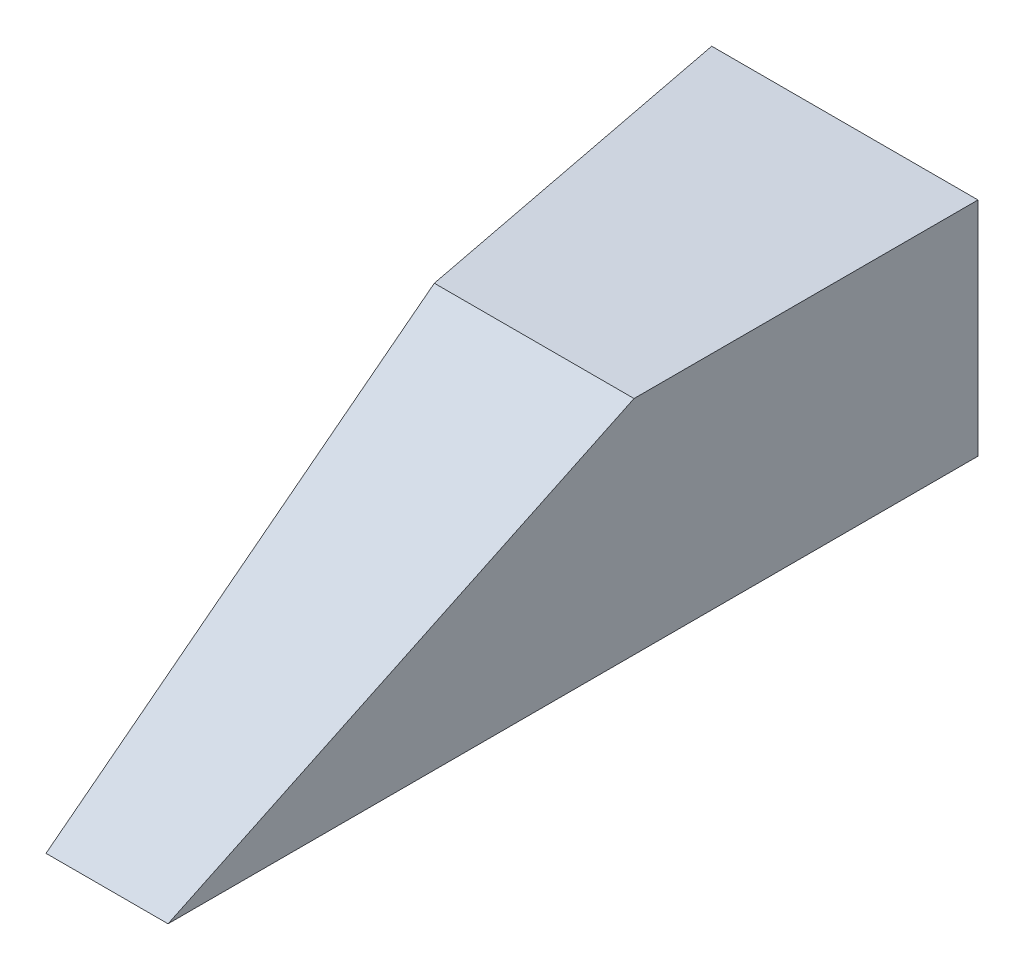
ISO-10303-21;
HEADER;
FILE_DESCRIPTION(('STEP AP214'),'2;1');
FILE_NAME('part.step','',(''),(''),'','','');
FILE_SCHEMA(('AUTOMOTIVE_DESIGN { 1 0 10303 214 1 1 1 1 }'));
ENDSEC;
DATA;
#1=APPLICATION_CONTEXT('core data for automotive mechanical design processes');
#2=APPLICATION_PROTOCOL_DEFINITION('international standard','automotive_design',2000,#1);
#3=PRODUCT_CONTEXT('',#1,'mechanical');
#4=PRODUCT('Part','Part','',(#3));
#5=PRODUCT_RELATED_PRODUCT_CATEGORY('part','',(#4));
#6=PRODUCT_DEFINITION_FORMATION('','',#4);
#7=PRODUCT_DEFINITION_CONTEXT('part definition',#1,'design');
#8=PRODUCT_DEFINITION('design','',#6,#7);
#9=PRODUCT_DEFINITION_SHAPE('','',#8);
#10=(LENGTH_UNIT() NAMED_UNIT(*) SI_UNIT(.MILLI.,.METRE.));
#11=(NAMED_UNIT(*) PLANE_ANGLE_UNIT() SI_UNIT($,.RADIAN.));
#12=(NAMED_UNIT(*) SI_UNIT($,.STERADIAN.) SOLID_ANGLE_UNIT());
#13=UNCERTAINTY_MEASURE_WITH_UNIT(LENGTH_MEASURE(1.E-05),#10,'distance_accuracy_value','');
#14=(GEOMETRIC_REPRESENTATION_CONTEXT(3) GLOBAL_UNCERTAINTY_ASSIGNED_CONTEXT((#13)) GLOBAL_UNIT_ASSIGNED_CONTEXT((#10,
#11,#12)) REPRESENTATION_CONTEXT('',''));
#15=CARTESIAN_POINT('',(0.,0.,0.));
#16=DIRECTION('',(0.,0.,1.));
#17=DIRECTION('',(1.,0.,0.));
#18=AXIS2_PLACEMENT_3D('',#15,#16,#17);
#19=CARTESIAN_POINT('',(0.,0.,0.));
#20=DIRECTION('',(0.,1.,0.));
#21=DIRECTION('',(0.,0.,1.));
#22=AXIS2_PLACEMENT_3D('',#19,#20,#21);
#23=PLANE('',#22);
#24=DIRECTION('',(0.,0.,1.));
#25=VECTOR('',#24,1.);
#26=CARTESIAN_POINT('',(0.,0.,0.));
#27=LINE('',#26,#25);
#28=CARTESIAN_POINT('',(0.,0.,-1854.2));
#29=VERTEX_POINT('',#28);
#30=CARTESIAN_POINT('',(0.,0.,0.));
#31=VERTEX_POINT('',#30);
#32=EDGE_CURVE('E84',#29,#31,#27,.T.);
#33=ORIENTED_EDGE('',*,*,#32,.T.);
#34=DIRECTION('',(1.,0.,0.));
#35=VECTOR('',#34,1.);
#36=CARTESIAN_POINT('',(0.,0.,0.));
#37=LINE('',#36,#35);
#38=CARTESIAN_POINT('',(-279.4,0.,0.));
#39=VERTEX_POINT('',#38);
#40=EDGE_CURVE('E61',#39,#31,#37,.T.);
#41=ORIENTED_EDGE('',*,*,#40,.F.);
#42=DIRECTION('',(-0.164398987305357,0.,-0.986393923832144));
#43=VECTOR('',#42,1.);
#44=CARTESIAN_POINT('',(-279.4,0.,0.));
#45=LINE('',#44,#43);
#46=CARTESIAN_POINT('',(-457.2,0.,-1066.8));
#47=VERTEX_POINT('',#46);
#48=EDGE_CURVE('E113',#39,#47,#45,.T.);
#49=ORIENTED_EDGE('',*,*,#48,.T.);
#50=DIRECTION('',(0.190021906565861,0.,0.981779850590281));
#51=VECTOR('',#50,1.);
#52=CARTESIAN_POINT('',(-609.6,0.,-1854.2));
#53=LINE('',#52,#51);
#54=CARTESIAN_POINT('',(-609.6,0.,-1854.2));
#55=VERTEX_POINT('',#54);
#56=EDGE_CURVE('E88',#55,#47,#53,.T.);
#57=ORIENTED_EDGE('',*,*,#56,.F.);
#58=DIRECTION('',(1.,0.,0.));
#59=VECTOR('',#58,1.);
#60=CARTESIAN_POINT('',(0.,0.,-1854.2));
#61=LINE('',#60,#59);
#62=EDGE_CURVE('E92',#55,#29,#61,.T.);
#63=ORIENTED_EDGE('',*,*,#62,.T.);
#64=EDGE_LOOP('',(#33,#41,#49,#57,#63));
#65=FACE_BOUND('',#64,.T.);
#66=ADVANCED_FACE('F39',(#65),#23,.F.);
#67=CARTESIAN_POINT('',(508.,0.,0.));
#68=DIRECTION('',(0.,-0.90286051882393,-0.429933580392348));
#69=DIRECTION('',(0.,0.429933580392348,-0.90286051882393));
#70=AXIS2_PLACEMENT_3D('',#67,#68,#69);
#71=PLANE('',#70);
#72=DIRECTION('',(0.,-0.429933580392348,0.90286051882393));
#73=VECTOR('',#72,1.);
#74=CARTESIAN_POINT('',(0.,0.,0.));
#75=LINE('',#74,#73);
#76=CARTESIAN_POINT('',(0.,508.,-1066.8));
#77=VERTEX_POINT('',#76);
#78=EDGE_CURVE('E82',#77,#31,#75,.T.);
#79=ORIENTED_EDGE('',*,*,#78,.F.);
#80=DIRECTION('',(-1.,0.,0.));
#81=VECTOR('',#80,1.);
#82=CARTESIAN_POINT('',(457.2,508.,-1066.8));
#83=LINE('',#82,#81);
#84=CARTESIAN_POINT('',(-457.2,508.,-1066.8));
#85=VERTEX_POINT('',#84);
#86=EDGE_CURVE('E47',#77,#85,#83,.T.);
#87=ORIENTED_EDGE('',*,*,#86,.T.);
#88=DIRECTION('',(-0.148801508186848,0.425147166248136,-0.892809049121087));
#89=VECTOR('',#88,1.);
#90=CARTESIAN_POINT('',(-311.537370085856,91.8210573881609,-192.824220515138));
#91=LINE('',#90,#89);
#92=EDGE_CURVE('E97',#39,#85,#91,.T.);
#93=ORIENTED_EDGE('',*,*,#92,.F.);
#94=ORIENTED_EDGE('',*,*,#40,.T.);
#95=EDGE_LOOP('',(#79,#87,#93,#94));
#96=FACE_BOUND('',#95,.T.);
#97=ADVANCED_FACE('F95',(#96),#71,.F.);
#98=CARTESIAN_POINT('',(0.,508.,-1854.2));
#99=DIRECTION('',(0.,0.,-1.));
#100=DIRECTION('',(-1.,0.,0.));
#101=AXIS2_PLACEMENT_3D('',#98,#99,#100);
#102=PLANE('',#101);
#103=DIRECTION('',(1.,0.,0.));
#104=VECTOR('',#103,1.);
#105=CARTESIAN_POINT('',(0.,508.,-1854.2));
#106=LINE('',#105,#104);
#107=CARTESIAN_POINT('',(-609.6,508.,-1854.2));
#108=VERTEX_POINT('',#107);
#109=CARTESIAN_POINT('',(0.,508.,-1854.2));
#110=VERTEX_POINT('',#109);
#111=EDGE_CURVE('E100',#108,#110,#106,.T.);
#112=ORIENTED_EDGE('',*,*,#111,.T.);
#113=DIRECTION('',(0.,-1.,0.));
#114=VECTOR('',#113,1.);
#115=CARTESIAN_POINT('',(0.,508.,-1854.2));
#116=LINE('',#115,#114);
#117=EDGE_CURVE('E53',#110,#29,#116,.T.);
#118=ORIENTED_EDGE('',*,*,#117,.T.);
#119=ORIENTED_EDGE('',*,*,#62,.F.);
#120=DIRECTION('',(0.,-1.,0.));
#121=VECTOR('',#120,1.);
#122=CARTESIAN_POINT('',(-609.6,508.,-1854.2));
#123=LINE('',#122,#121);
#124=EDGE_CURVE('E118',#108,#55,#123,.T.);
#125=ORIENTED_EDGE('',*,*,#124,.F.);
#126=EDGE_LOOP('',(#112,#118,#119,#125));
#127=FACE_BOUND('',#126,.T.);
#128=ADVANCED_FACE('F130',(#127),#102,.T.);
#129=CARTESIAN_POINT('',(0.,508.,0.));
#130=DIRECTION('',(0.,-1.,0.));
#131=DIRECTION('',(0.,0.,-1.));
#132=AXIS2_PLACEMENT_3D('',#129,#130,#131);
#133=PLANE('',#132);
#134=DIRECTION('',(0.,0.,1.));
#135=VECTOR('',#134,1.);
#136=CARTESIAN_POINT('',(0.,508.,0.));
#137=LINE('',#136,#135);
#138=EDGE_CURVE('E11',#110,#77,#137,.T.);
#139=ORIENTED_EDGE('',*,*,#138,.F.);
#140=ORIENTED_EDGE('',*,*,#111,.F.);
#141=DIRECTION('',(0.190021906565861,0.,0.981779850590281));
#142=VECTOR('',#141,1.);
#143=CARTESIAN_POINT('',(-609.6,508.,-1854.2));
#144=LINE('',#143,#142);
#145=EDGE_CURVE('E122',#108,#85,#144,.T.);
#146=ORIENTED_EDGE('',*,*,#145,.T.);
#147=ORIENTED_EDGE('',*,*,#86,.F.);
#148=EDGE_LOOP('',(#139,#140,#146,#147));
#149=FACE_BOUND('',#148,.T.);
#150=ADVANCED_FACE('F134',(#149),#133,.F.);
#151=CARTESIAN_POINT('',(-279.4,508.,0.));
#152=DIRECTION('',(-0.986393923832144,0.,0.164398987305357));
#153=DIRECTION('',(0.164398987305357,0.,0.986393923832144));
#154=AXIS2_PLACEMENT_3D('',#151,#152,#153);
#155=PLANE('',#154);
#156=ORIENTED_EDGE('',*,*,#48,.F.);
#157=ORIENTED_EDGE('',*,*,#92,.T.);
#158=DIRECTION('',(0.,-1.,0.));
#159=VECTOR('',#158,1.);
#160=CARTESIAN_POINT('',(-457.2,508.,-1066.8));
#161=LINE('',#160,#159);
#162=EDGE_CURVE('E108',#85,#47,#161,.T.);
#163=ORIENTED_EDGE('',*,*,#162,.T.);
#164=EDGE_LOOP('',(#156,#157,#163));
#165=FACE_BOUND('',#164,.T.);
#166=ADVANCED_FACE('F139',(#165),#155,.T.);
#167=CARTESIAN_POINT('',(-609.6,508.,-1854.2));
#168=DIRECTION('',(0.981779850590281,0.,-0.190021906565861));
#169=DIRECTION('',(-0.190021906565861,0.,-0.981779850590281));
#170=AXIS2_PLACEMENT_3D('',#167,#168,#169);
#171=PLANE('',#170);
#172=ORIENTED_EDGE('',*,*,#56,.T.);
#173=ORIENTED_EDGE('',*,*,#162,.F.);
#174=ORIENTED_EDGE('',*,*,#145,.F.);
#175=ORIENTED_EDGE('',*,*,#124,.T.);
#176=EDGE_LOOP('',(#172,#173,#174,#175));
#177=FACE_BOUND('',#176,.T.);
#178=ADVANCED_FACE('F137',(#177),#171,.F.);
#179=CARTESIAN_POINT('',(0.,508.,0.));
#180=DIRECTION('',(1.,0.,0.));
#181=DIRECTION('',(0.,0.,-1.));
#182=AXIS2_PLACEMENT_3D('',#179,#180,#181);
#183=PLANE('',#182);
#184=ORIENTED_EDGE('',*,*,#78,.T.);
#185=ORIENTED_EDGE('',*,*,#32,.F.);
#186=ORIENTED_EDGE('',*,*,#117,.F.);
#187=ORIENTED_EDGE('',*,*,#138,.T.);
#188=EDGE_LOOP('',(#184,#185,#186,#187));
#189=FACE_BOUND('',#188,.T.);
#190=ADVANCED_FACE('F83',(#189),#183,.T.);
#191=CLOSED_SHELL('',(#66,#97,#128,#150,#166,#178,#190));
#192=MANIFOLD_SOLID_BREP('B2',#191);
#193=ADVANCED_BREP_SHAPE_REPRESENTATION('',(#18,#192),#14);
#194=SHAPE_DEFINITION_REPRESENTATION(#9,#193);
ENDSEC;
END-ISO-10303-21;
